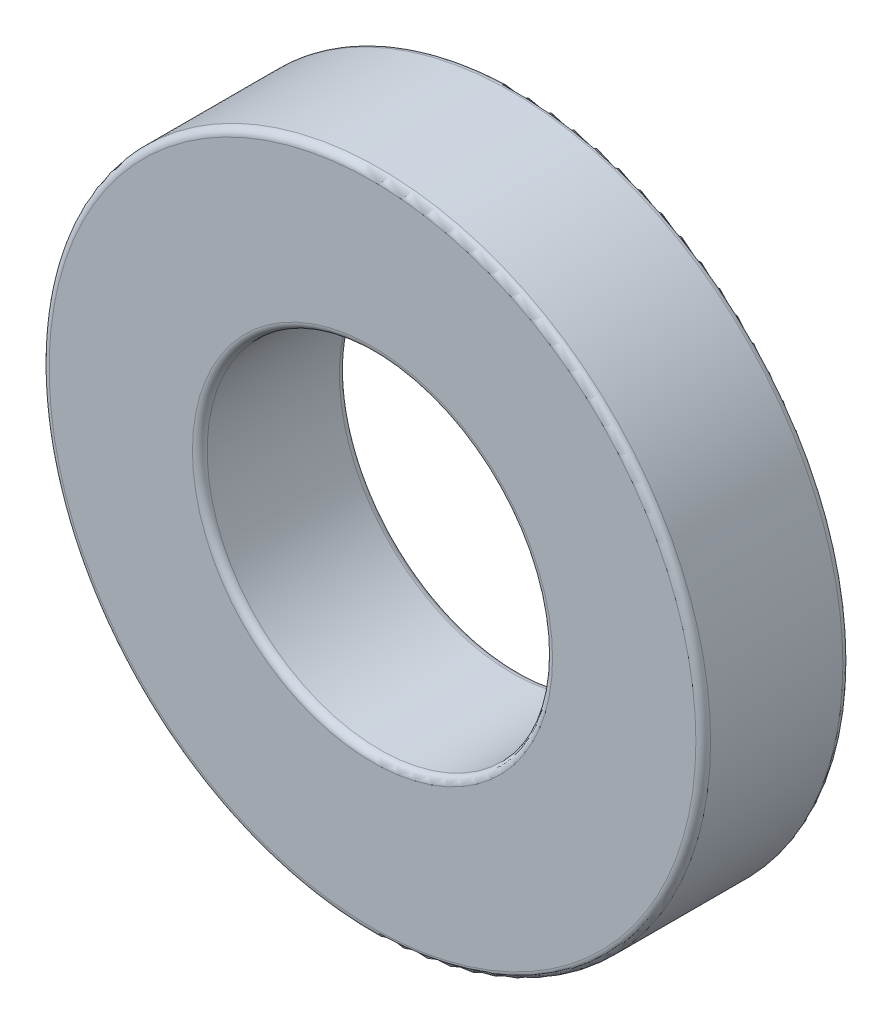
ISO-10303-21;
HEADER;
FILE_DESCRIPTION(('STEP AP214'),'2;1');
FILE_NAME('part.step','',(''),(''),'','','');
FILE_SCHEMA(('AUTOMOTIVE_DESIGN { 1 0 10303 214 1 1 1 1 }'));
ENDSEC;
DATA;
#1=APPLICATION_CONTEXT('core data for automotive mechanical design processes');
#2=APPLICATION_PROTOCOL_DEFINITION('international standard','automotive_design',2000,#1);
#3=PRODUCT_CONTEXT('',#1,'mechanical');
#4=PRODUCT('Part','Part','',(#3));
#5=PRODUCT_RELATED_PRODUCT_CATEGORY('part','',(#4));
#6=PRODUCT_DEFINITION_FORMATION('','',#4);
#7=PRODUCT_DEFINITION_CONTEXT('part definition',#1,'design');
#8=PRODUCT_DEFINITION('design','',#6,#7);
#9=PRODUCT_DEFINITION_SHAPE('','',#8);
#10=(LENGTH_UNIT() NAMED_UNIT(*) SI_UNIT(.MILLI.,.METRE.));
#11=(NAMED_UNIT(*) PLANE_ANGLE_UNIT() SI_UNIT($,.RADIAN.));
#12=(NAMED_UNIT(*) SI_UNIT($,.STERADIAN.) SOLID_ANGLE_UNIT());
#13=UNCERTAINTY_MEASURE_WITH_UNIT(LENGTH_MEASURE(1.E-05),#10,'distance_accuracy_value','');
#14=(GEOMETRIC_REPRESENTATION_CONTEXT(3) GLOBAL_UNCERTAINTY_ASSIGNED_CONTEXT((#13)) GLOBAL_UNIT_ASSIGNED_CONTEXT((#10,
#11,#12)) REPRESENTATION_CONTEXT('',''));
#15=CARTESIAN_POINT('',(0.,0.,0.));
#16=DIRECTION('',(0.,0.,1.));
#17=DIRECTION('',(1.,0.,0.));
#18=AXIS2_PLACEMENT_3D('',#15,#16,#17);
#19=CARTESIAN_POINT('',(0.,0.,2.));
#20=DIRECTION('',(0.,0.,1.));
#21=DIRECTION('',(1.,0.,0.));
#22=AXIS2_PLACEMENT_3D('',#19,#20,#21);
#23=PLANE('',#22);
#24=CARTESIAN_POINT('',(0.,0.,2.));
#25=DIRECTION('',(0.,0.,1.));
#26=DIRECTION('',(1.,0.,0.));
#27=AXIS2_PLACEMENT_3D('',#24,#25,#26);
#28=CIRCLE('',#27,2.45);
#29=CARTESIAN_POINT('',(2.45,0.,2.));
#30=VERTEX_POINT('',#29);
#31=EDGE_CURVE('E41',#30,#30,#28,.F.);
#32=ORIENTED_EDGE('',*,*,#31,.T.);
#33=EDGE_LOOP('',(#32));
#34=FACE_BOUND('',#33,.T.);
#35=CARTESIAN_POINT('',(0.,0.,2.));
#36=DIRECTION('',(0.,0.,1.));
#37=DIRECTION('',(1.,0.,0.));
#38=AXIS2_PLACEMENT_3D('',#35,#36,#37);
#39=CIRCLE('',#38,4.4);
#40=CARTESIAN_POINT('',(4.4,0.,2.));
#41=VERTEX_POINT('',#40);
#42=EDGE_CURVE('E45',#41,#41,#39,.T.);
#43=ORIENTED_EDGE('',*,*,#42,.T.);
#44=EDGE_LOOP('',(#43));
#45=FACE_BOUND('',#44,.T.);
#46=ADVANCED_FACE('F30',(#34,#45),#23,.T.);
#47=CARTESIAN_POINT('',(0.,0.,0.));
#48=DIRECTION('',(0.,0.,1.));
#49=DIRECTION('',(1.,0.,0.));
#50=AXIS2_PLACEMENT_3D('',#47,#48,#49);
#51=PLANE('',#50);
#52=CARTESIAN_POINT('',(0.,0.,0.));
#53=DIRECTION('',(0.,0.,1.));
#54=DIRECTION('',(1.,0.,0.));
#55=AXIS2_PLACEMENT_3D('',#52,#53,#54);
#56=CIRCLE('',#55,2.45);
#57=CARTESIAN_POINT('',(2.45,0.,0.));
#58=VERTEX_POINT('',#57);
#59=EDGE_CURVE('E56',#58,#58,#56,.T.);
#60=ORIENTED_EDGE('',*,*,#59,.T.);
#61=EDGE_LOOP('',(#60));
#62=FACE_BOUND('',#61,.T.);
#63=CARTESIAN_POINT('',(0.,0.,0.));
#64=DIRECTION('',(0.,0.,1.));
#65=DIRECTION('',(1.,0.,0.));
#66=AXIS2_PLACEMENT_3D('',#63,#64,#65);
#67=CIRCLE('',#66,4.4);
#68=CARTESIAN_POINT('',(4.4,0.,0.));
#69=VERTEX_POINT('',#68);
#70=EDGE_CURVE('E59',#69,#69,#67,.F.);
#71=ORIENTED_EDGE('',*,*,#70,.T.);
#72=EDGE_LOOP('',(#71));
#73=FACE_BOUND('',#72,.T.);
#74=ADVANCED_FACE('F63',(#62,#73),#51,.F.);
#75=CARTESIAN_POINT('',(0.,0.,2.));
#76=DIRECTION('',(0.,0.,-1.));
#77=DIRECTION('',(-1.,0.,0.));
#78=AXIS2_PLACEMENT_3D('',#75,#76,#77);
#79=CYLINDRICAL_SURFACE('',#78,4.5);
#80=CARTESIAN_POINT('',(0.,0.,0.1));
#81=DIRECTION('',(0.,0.,1.));
#82=DIRECTION('',(1.,0.,0.));
#83=AXIS2_PLACEMENT_3D('',#80,#81,#82);
#84=CIRCLE('',#83,4.5);
#85=CARTESIAN_POINT('',(4.5,0.,0.1));
#86=VERTEX_POINT('',#85);
#87=EDGE_CURVE('E10',#86,#86,#84,.T.);
#88=ORIENTED_EDGE('',*,*,#87,.T.);
#89=EDGE_LOOP('',(#88));
#90=FACE_BOUND('',#89,.T.);
#91=CARTESIAN_POINT('',(0.,0.,1.9));
#92=DIRECTION('',(0.,0.,1.));
#93=DIRECTION('',(1.,0.,0.));
#94=AXIS2_PLACEMENT_3D('',#91,#92,#93);
#95=CIRCLE('',#94,4.5);
#96=CARTESIAN_POINT('',(4.5,0.,1.9));
#97=VERTEX_POINT('',#96);
#98=EDGE_CURVE('E37',#97,#97,#95,.F.);
#99=ORIENTED_EDGE('',*,*,#98,.T.);
#100=EDGE_LOOP('',(#99));
#101=FACE_BOUND('',#100,.T.);
#102=ADVANCED_FACE('F83',(#90,#101),#79,.T.);
#103=CARTESIAN_POINT('',(0.,0.,2.));
#104=DIRECTION('',(0.,0.,-1.));
#105=DIRECTION('',(-1.,0.,0.));
#106=AXIS2_PLACEMENT_3D('',#103,#104,#105);
#107=CYLINDRICAL_SURFACE('',#106,2.35);
#108=CARTESIAN_POINT('',(0.,0.,0.1));
#109=DIRECTION('',(0.,0.,1.));
#110=DIRECTION('',(1.,0.,0.));
#111=AXIS2_PLACEMENT_3D('',#108,#109,#110);
#112=CIRCLE('',#111,2.35);
#113=CARTESIAN_POINT('',(2.35,0.,0.1));
#114=VERTEX_POINT('',#113);
#115=EDGE_CURVE('E50',#114,#114,#112,.F.);
#116=ORIENTED_EDGE('',*,*,#115,.T.);
#117=EDGE_LOOP('',(#116));
#118=FACE_BOUND('',#117,.T.);
#119=CARTESIAN_POINT('',(0.,0.,1.9));
#120=DIRECTION('',(0.,0.,1.));
#121=DIRECTION('',(1.,0.,0.));
#122=AXIS2_PLACEMENT_3D('',#119,#120,#121);
#123=CIRCLE('',#122,2.35);
#124=CARTESIAN_POINT('',(2.35,0.,1.9));
#125=VERTEX_POINT('',#124);
#126=EDGE_CURVE('E53',#125,#125,#123,.T.);
#127=ORIENTED_EDGE('',*,*,#126,.T.);
#128=EDGE_LOOP('',(#127));
#129=FACE_BOUND('',#128,.T.);
#130=ADVANCED_FACE('F88',(#118,#129),#107,.F.);
#131=CARTESIAN_POINT('',(0.,0.,0.1));
#132=DIRECTION('',(0.,0.,1.));
#133=DIRECTION('',(1.,0.,0.));
#134=AXIS2_PLACEMENT_3D('',#131,#132,#133);
#135=TOROIDAL_SURFACE('',#134,2.45,0.1);
#136=ORIENTED_EDGE('',*,*,#115,.F.);
#137=EDGE_LOOP('',(#136));
#138=FACE_BOUND('',#137,.T.);
#139=ORIENTED_EDGE('',*,*,#59,.F.);
#140=EDGE_LOOP('',(#139));
#141=FACE_BOUND('',#140,.T.);
#142=ADVANCED_FACE('F74',(#138,#141),#135,.T.);
#143=CARTESIAN_POINT('',(0.,0.,1.9));
#144=DIRECTION('',(0.,0.,1.));
#145=DIRECTION('',(1.,0.,0.));
#146=AXIS2_PLACEMENT_3D('',#143,#144,#145);
#147=TOROIDAL_SURFACE('',#146,2.45,0.1);
#148=ORIENTED_EDGE('',*,*,#31,.F.);
#149=EDGE_LOOP('',(#148));
#150=FACE_BOUND('',#149,.T.);
#151=ORIENTED_EDGE('',*,*,#126,.F.);
#152=EDGE_LOOP('',(#151));
#153=FACE_BOUND('',#152,.T.);
#154=ADVANCED_FACE('F68',(#150,#153),#147,.T.);
#155=CARTESIAN_POINT('',(0.,0.,0.1));
#156=DIRECTION('',(0.,0.,1.));
#157=DIRECTION('',(1.,0.,0.));
#158=AXIS2_PLACEMENT_3D('',#155,#156,#157);
#159=TOROIDAL_SURFACE('',#158,4.4,0.1);
#160=ORIENTED_EDGE('',*,*,#70,.F.);
#161=EDGE_LOOP('',(#160));
#162=FACE_BOUND('',#161,.T.);
#163=ORIENTED_EDGE('',*,*,#87,.F.);
#164=EDGE_LOOP('',(#163));
#165=FACE_BOUND('',#164,.T.);
#166=ADVANCED_FACE('F65',(#162,#165),#159,.T.);
#167=CARTESIAN_POINT('',(0.,0.,1.9));
#168=DIRECTION('',(0.,0.,1.));
#169=DIRECTION('',(1.,0.,0.));
#170=AXIS2_PLACEMENT_3D('',#167,#168,#169);
#171=TOROIDAL_SURFACE('',#170,4.4,0.1);
#172=ORIENTED_EDGE('',*,*,#98,.F.);
#173=EDGE_LOOP('',(#172));
#174=FACE_BOUND('',#173,.T.);
#175=ORIENTED_EDGE('',*,*,#42,.F.);
#176=EDGE_LOOP('',(#175));
#177=FACE_BOUND('',#176,.T.);
#178=ADVANCED_FACE('F32',(#174,#177),#171,.T.);
#179=CLOSED_SHELL('',(#46,#74,#102,#130,#142,#154,#166,#178));
#180=MANIFOLD_SOLID_BREP('B2',#179);
#181=ADVANCED_BREP_SHAPE_REPRESENTATION('',(#18,#180),#14);
#182=SHAPE_DEFINITION_REPRESENTATION(#9,#181);
ENDSEC;
END-ISO-10303-21;
